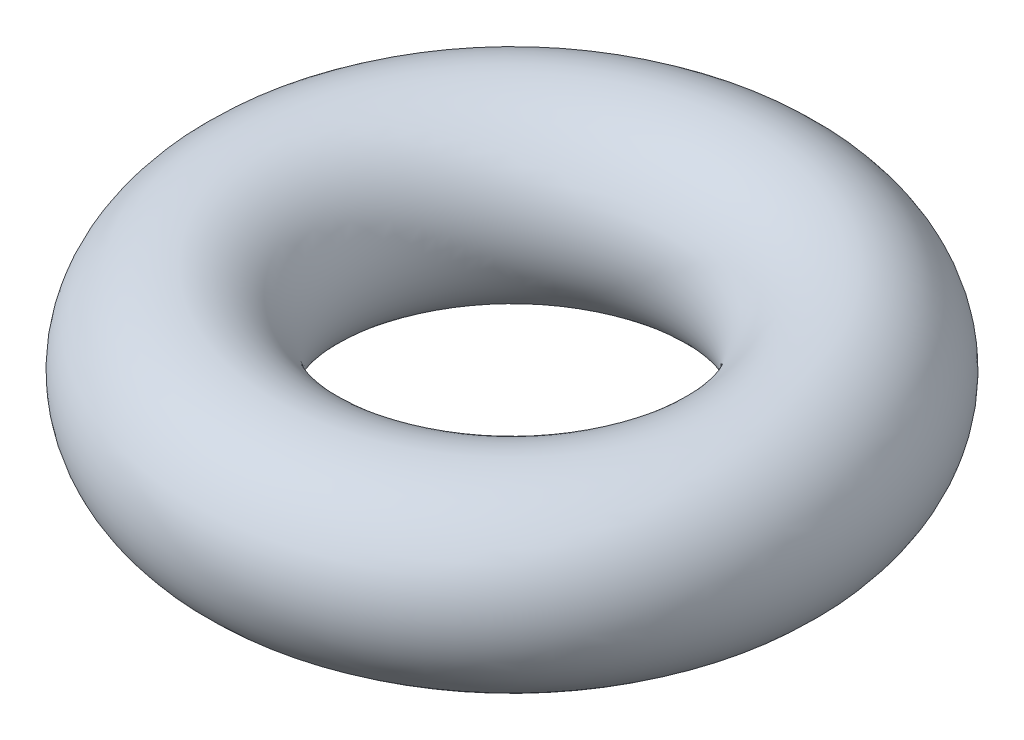
ISO-10303-21;
HEADER;
FILE_DESCRIPTION(('STEP AP214'),'2;1');
FILE_NAME('part.step','',(''),(''),'','','');
FILE_SCHEMA(('AUTOMOTIVE_DESIGN { 1 0 10303 214 1 1 1 1 }'));
ENDSEC;
DATA;
#1=APPLICATION_CONTEXT('core data for automotive mechanical design processes');
#2=APPLICATION_PROTOCOL_DEFINITION('international standard','automotive_design',2000,#1);
#3=PRODUCT_CONTEXT('',#1,'mechanical');
#4=PRODUCT('Part','Part','',(#3));
#5=PRODUCT_RELATED_PRODUCT_CATEGORY('part','',(#4));
#6=PRODUCT_DEFINITION_FORMATION('','',#4);
#7=PRODUCT_DEFINITION_CONTEXT('part definition',#1,'design');
#8=PRODUCT_DEFINITION('design','',#6,#7);
#9=PRODUCT_DEFINITION_SHAPE('','',#8);
#10=(LENGTH_UNIT() NAMED_UNIT(*) SI_UNIT(.MILLI.,.METRE.));
#11=(NAMED_UNIT(*) PLANE_ANGLE_UNIT() SI_UNIT($,.RADIAN.));
#12=(NAMED_UNIT(*) SI_UNIT($,.STERADIAN.) SOLID_ANGLE_UNIT());
#13=UNCERTAINTY_MEASURE_WITH_UNIT(LENGTH_MEASURE(1.E-05),#10,'distance_accuracy_value','');
#14=(GEOMETRIC_REPRESENTATION_CONTEXT(3) GLOBAL_UNCERTAINTY_ASSIGNED_CONTEXT((#13)) GLOBAL_UNIT_ASSIGNED_CONTEXT((#10,
#11,#12)) REPRESENTATION_CONTEXT('',''));
#15=CARTESIAN_POINT('',(0.,0.,0.));
#16=DIRECTION('',(0.,0.,1.));
#17=DIRECTION('',(1.,0.,0.));
#18=AXIS2_PLACEMENT_3D('',#15,#16,#17);
#19=CARTESIAN_POINT('',(30.8833279845544,0.,0.));
#20=DIRECTION('',(0.,1.,0.));
#21=DIRECTION('',(0.,0.,1.));
#22=AXIS2_PLACEMENT_3D('',#19,#20,#21);
#23=TOROIDAL_SURFACE('',#22,30.8833279845544,11.7689806089137);
#24=CARTESIAN_POINT('',(0.,0.,0.));
#25=DIRECTION('',(0.,0.,1.));
#26=DIRECTION('',(1.,0.,0.));
#27=AXIS2_PLACEMENT_3D('',#24,#25,#26);
#28=CIRCLE('',#27,11.7689806089137);
#29=CARTESIAN_POINT('',(-11.7689806089137,0.,0.));
#30=VERTEX_POINT('',#29);
#31=EDGE_CURVE('E10',#30,#30,#28,.T.);
#32=CARTESIAN_POINT('',(30.8833279845544,0.,0.));
#33=DIRECTION('',(0.,1.,0.));
#34=DIRECTION('',(0.,0.,1.));
#35=AXIS2_PLACEMENT_3D('',#32,#33,#34);
#36=CIRCLE('',#35,42.6523085934681);
#37=EDGE_CURVE('',#30,#30,#36,.T.);
#38=ORIENTED_EDGE('',*,*,#31,.T.);
#39=ORIENTED_EDGE('',*,*,#31,.F.);
#40=ORIENTED_EDGE('',*,*,#37,.T.);
#41=ORIENTED_EDGE('',*,*,#37,.F.);
#42=EDGE_LOOP('',(#38,#40,#39,#41));
#43=FACE_BOUND('',#42,.T.);
#44=ADVANCED_FACE('F37',(#43),#23,.T.);
#45=CLOSED_SHELL('',(#44));
#46=MANIFOLD_SOLID_BREP('B2',#45);
#47=ADVANCED_BREP_SHAPE_REPRESENTATION('',(#18,#46),#14);
#48=SHAPE_DEFINITION_REPRESENTATION(#9,#47);
ENDSEC;
END-ISO-10303-21;
